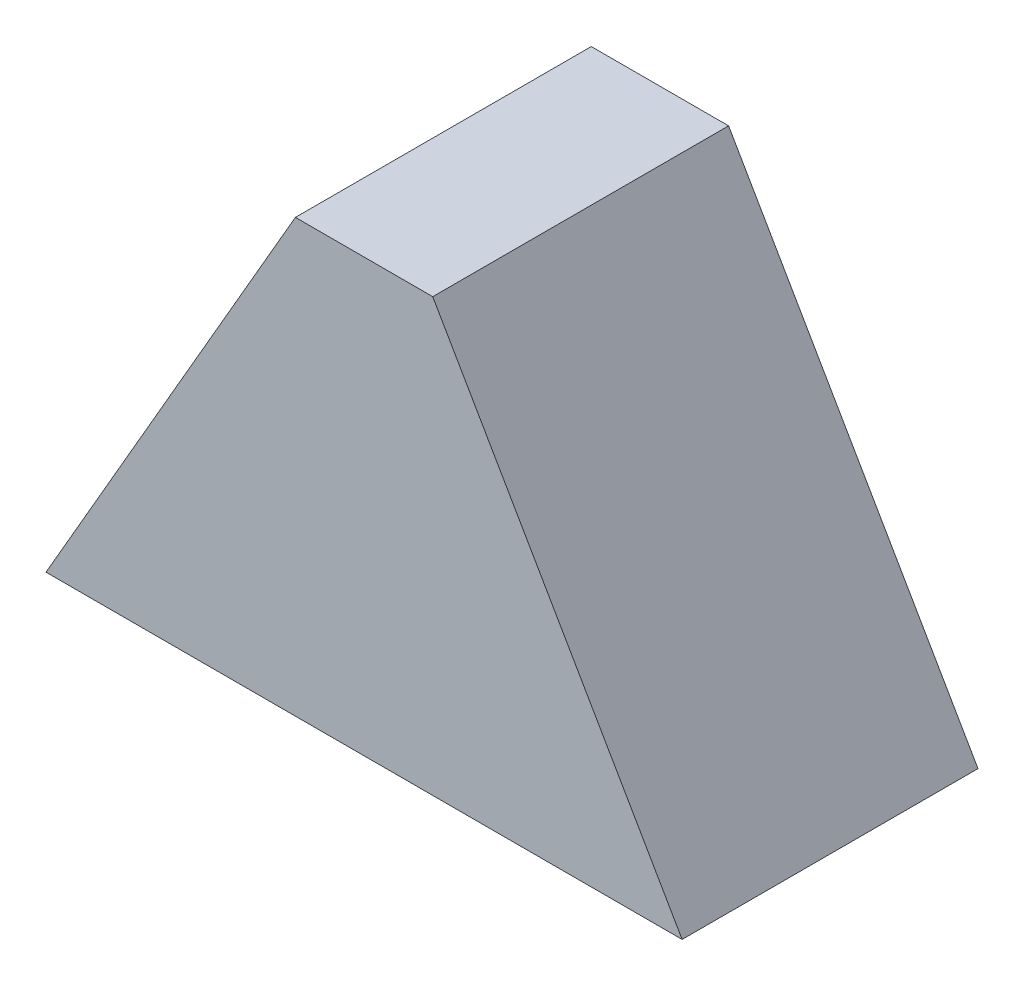
ISO-10303-21;
HEADER;
FILE_DESCRIPTION(('STEP AP214'),'2;1');
FILE_NAME('part.step','',(''),(''),'','','');
FILE_SCHEMA(('AUTOMOTIVE_DESIGN { 1 0 10303 214 1 1 1 1 }'));
ENDSEC;
DATA;
#1=APPLICATION_CONTEXT('core data for automotive mechanical design processes');
#2=APPLICATION_PROTOCOL_DEFINITION('international standard','automotive_design',2000,#1);
#3=PRODUCT_CONTEXT('',#1,'mechanical');
#4=PRODUCT('Part','Part','',(#3));
#5=PRODUCT_RELATED_PRODUCT_CATEGORY('part','',(#4));
#6=PRODUCT_DEFINITION_FORMATION('','',#4);
#7=PRODUCT_DEFINITION_CONTEXT('part definition',#1,'design');
#8=PRODUCT_DEFINITION('design','',#6,#7);
#9=PRODUCT_DEFINITION_SHAPE('','',#8);
#10=(LENGTH_UNIT() NAMED_UNIT(*) SI_UNIT(.MILLI.,.METRE.));
#11=(NAMED_UNIT(*) PLANE_ANGLE_UNIT() SI_UNIT($,.RADIAN.));
#12=(NAMED_UNIT(*) SI_UNIT($,.STERADIAN.) SOLID_ANGLE_UNIT());
#13=UNCERTAINTY_MEASURE_WITH_UNIT(LENGTH_MEASURE(1.E-05),#10,'distance_accuracy_value','');
#14=(GEOMETRIC_REPRESENTATION_CONTEXT(3) GLOBAL_UNCERTAINTY_ASSIGNED_CONTEXT((#13)) GLOBAL_UNIT_ASSIGNED_CONTEXT((#10,
#11,#12)) REPRESENTATION_CONTEXT('',''));
#15=CARTESIAN_POINT('',(0.,0.,0.));
#16=DIRECTION('',(0.,0.,1.));
#17=DIRECTION('',(1.,0.,0.));
#18=AXIS2_PLACEMENT_3D('',#15,#16,#17);
#19=CARTESIAN_POINT('',(430.,0.,200.));
#20=DIRECTION('',(0.,1.,0.));
#21=DIRECTION('',(0.,0.,1.));
#22=AXIS2_PLACEMENT_3D('',#19,#20,#21);
#23=PLANE('',#22);
#24=DIRECTION('',(1.,0.,0.));
#25=VECTOR('',#24,1.);
#26=CARTESIAN_POINT('',(430.,0.,0.));
#27=LINE('',#26,#25);
#28=CARTESIAN_POINT('',(0.,0.,0.));
#29=VERTEX_POINT('',#28);
#30=CARTESIAN_POINT('',(430.,0.,0.));
#31=VERTEX_POINT('',#30);
#32=EDGE_CURVE('E100',#29,#31,#27,.T.);
#33=ORIENTED_EDGE('',*,*,#32,.T.);
#34=DIRECTION('',(0.,0.,-1.));
#35=VECTOR('',#34,1.);
#36=CARTESIAN_POINT('',(430.,0.,200.));
#37=LINE('',#36,#35);
#38=CARTESIAN_POINT('',(430.,0.,200.));
#39=VERTEX_POINT('',#38);
#40=EDGE_CURVE('E11',#39,#31,#37,.T.);
#41=ORIENTED_EDGE('',*,*,#40,.F.);
#42=DIRECTION('',(1.,0.,0.));
#43=VECTOR('',#42,1.);
#44=CARTESIAN_POINT('',(430.,0.,200.));
#45=LINE('',#44,#43);
#46=CARTESIAN_POINT('',(0.,0.,200.));
#47=VERTEX_POINT('',#46);
#48=EDGE_CURVE('E88',#47,#39,#45,.T.);
#49=ORIENTED_EDGE('',*,*,#48,.F.);
#50=DIRECTION('',(0.,0.,-1.));
#51=VECTOR('',#50,1.);
#52=CARTESIAN_POINT('',(0.,0.,200.));
#53=LINE('',#52,#51);
#54=EDGE_CURVE('E96',#47,#29,#53,.T.);
#55=ORIENTED_EDGE('',*,*,#54,.T.);
#56=EDGE_LOOP('',(#33,#41,#49,#55));
#57=FACE_BOUND('',#56,.T.);
#58=ADVANCED_FACE('F37',(#57),#23,.F.);
#59=CARTESIAN_POINT('',(261.413721396627,292.,200.));
#60=DIRECTION('',(-0.866025403784436,-0.500000000000004,0.));
#61=DIRECTION('',(0.500000000000005,-0.866025403784436,0.));
#62=AXIS2_PLACEMENT_3D('',#59,#60,#61);
#63=PLANE('',#62);
#64=DIRECTION('',(-0.500000000000004,0.866025403784436,0.));
#65=VECTOR('',#64,1.);
#66=CARTESIAN_POINT('',(261.413721396627,292.,0.));
#67=LINE('',#66,#65);
#68=CARTESIAN_POINT('',(261.413721396627,292.,0.));
#69=VERTEX_POINT('',#68);
#70=EDGE_CURVE('E92',#31,#69,#67,.T.);
#71=ORIENTED_EDGE('',*,*,#70,.T.);
#72=DIRECTION('',(0.,0.,-1.));
#73=VECTOR('',#72,1.);
#74=CARTESIAN_POINT('',(261.413721396627,292.,200.));
#75=LINE('',#74,#73);
#76=CARTESIAN_POINT('',(261.413721396627,292.,200.));
#77=VERTEX_POINT('',#76);
#78=EDGE_CURVE('E45',#77,#69,#75,.T.);
#79=ORIENTED_EDGE('',*,*,#78,.F.);
#80=DIRECTION('',(-0.500000000000004,0.866025403784436,0.));
#81=VECTOR('',#80,1.);
#82=CARTESIAN_POINT('',(261.413721396627,292.,200.));
#83=LINE('',#82,#81);
#84=EDGE_CURVE('E83',#39,#77,#83,.T.);
#85=ORIENTED_EDGE('',*,*,#84,.F.);
#86=ORIENTED_EDGE('',*,*,#40,.T.);
#87=EDGE_LOOP('',(#71,#79,#85,#86));
#88=FACE_BOUND('',#87,.T.);
#89=ADVANCED_FACE('F91',(#88),#63,.F.);
#90=CARTESIAN_POINT('',(168.586278603372,292.,200.));
#91=DIRECTION('',(0.,-1.,0.));
#92=DIRECTION('',(0.,0.,-1.));
#93=AXIS2_PLACEMENT_3D('',#90,#91,#92);
#94=PLANE('',#93);
#95=DIRECTION('',(-1.,0.,0.));
#96=VECTOR('',#95,1.);
#97=CARTESIAN_POINT('',(168.586278603372,292.,0.));
#98=LINE('',#97,#96);
#99=CARTESIAN_POINT('',(168.586278603372,292.,0.));
#100=VERTEX_POINT('',#99);
#101=EDGE_CURVE('E70',#69,#100,#98,.T.);
#102=ORIENTED_EDGE('',*,*,#101,.T.);
#103=DIRECTION('',(0.,0.,-1.));
#104=VECTOR('',#103,1.);
#105=CARTESIAN_POINT('',(168.586278603372,292.,200.));
#106=LINE('',#105,#104);
#107=CARTESIAN_POINT('',(168.586278603372,292.,200.));
#108=VERTEX_POINT('',#107);
#109=EDGE_CURVE('E93',#108,#100,#106,.T.);
#110=ORIENTED_EDGE('',*,*,#109,.F.);
#111=DIRECTION('',(-1.,0.,0.));
#112=VECTOR('',#111,1.);
#113=CARTESIAN_POINT('',(168.586278603372,292.,200.));
#114=LINE('',#113,#112);
#115=EDGE_CURVE('E86',#77,#108,#114,.T.);
#116=ORIENTED_EDGE('',*,*,#115,.F.);
#117=ORIENTED_EDGE('',*,*,#78,.T.);
#118=EDGE_LOOP('',(#102,#110,#116,#117));
#119=FACE_BOUND('',#118,.T.);
#120=ADVANCED_FACE('F94',(#119),#94,.F.);
#121=CARTESIAN_POINT('',(0.,0.,200.));
#122=DIRECTION('',(0.866025403784436,-0.500000000000004,0.));
#123=DIRECTION('',(0.500000000000004,0.866025403784436,0.));
#124=AXIS2_PLACEMENT_3D('',#121,#122,#123);
#125=PLANE('',#124);
#126=DIRECTION('',(-0.500000000000004,-0.866025403784436,0.));
#127=VECTOR('',#126,1.);
#128=CARTESIAN_POINT('',(0.,0.,0.));
#129=LINE('',#128,#127);
#130=EDGE_CURVE('E76',#100,#29,#129,.T.);
#131=ORIENTED_EDGE('',*,*,#130,.T.);
#132=ORIENTED_EDGE('',*,*,#54,.F.);
#133=DIRECTION('',(-0.500000000000004,-0.866025403784436,0.));
#134=VECTOR('',#133,1.);
#135=CARTESIAN_POINT('',(0.,0.,200.));
#136=LINE('',#135,#134);
#137=EDGE_CURVE('E53',#108,#47,#136,.T.);
#138=ORIENTED_EDGE('',*,*,#137,.F.);
#139=ORIENTED_EDGE('',*,*,#109,.T.);
#140=EDGE_LOOP('',(#131,#132,#138,#139));
#141=FACE_BOUND('',#140,.T.);
#142=ADVANCED_FACE('F107',(#141),#125,.F.);
#143=CARTESIAN_POINT('',(0.,0.,200.));
#144=DIRECTION('',(0.,0.,-1.));
#145=DIRECTION('',(-1.,0.,0.));
#146=AXIS2_PLACEMENT_3D('',#143,#144,#145);
#147=PLANE('',#146);
#148=ORIENTED_EDGE('',*,*,#48,.T.);
#149=ORIENTED_EDGE('',*,*,#84,.T.);
#150=ORIENTED_EDGE('',*,*,#115,.T.);
#151=ORIENTED_EDGE('',*,*,#137,.T.);
#152=EDGE_LOOP('',(#148,#149,#150,#151));
#153=FACE_BOUND('',#152,.T.);
#154=ADVANCED_FACE('F84',(#153),#147,.F.);
#155=CARTESIAN_POINT('',(0.,0.,0.));
#156=DIRECTION('',(0.,0.,-1.));
#157=DIRECTION('',(-1.,0.,0.));
#158=AXIS2_PLACEMENT_3D('',#155,#156,#157);
#159=PLANE('',#158);
#160=ORIENTED_EDGE('',*,*,#32,.F.);
#161=ORIENTED_EDGE('',*,*,#130,.F.);
#162=ORIENTED_EDGE('',*,*,#101,.F.);
#163=ORIENTED_EDGE('',*,*,#70,.F.);
#164=EDGE_LOOP('',(#160,#161,#162,#163));
#165=FACE_BOUND('',#164,.T.);
#166=ADVANCED_FACE('F110',(#165),#159,.T.);
#167=CLOSED_SHELL('',(#58,#89,#120,#142,#154,#166));
#168=MANIFOLD_SOLID_BREP('B2',#167);
#169=ADVANCED_BREP_SHAPE_REPRESENTATION('',(#18,#168),#14);
#170=SHAPE_DEFINITION_REPRESENTATION(#9,#169);
ENDSEC;
END-ISO-10303-21;
